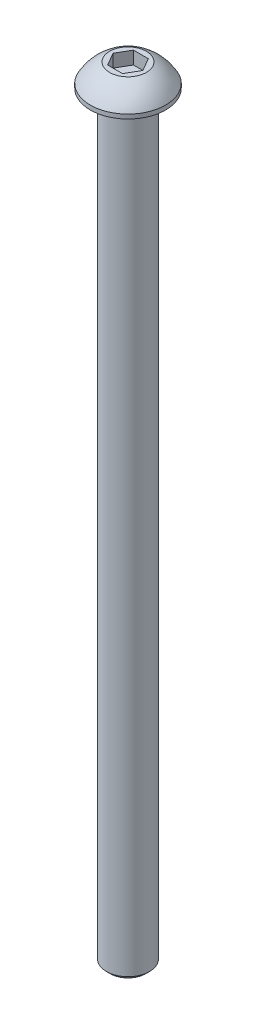
ISO-10303-21;
HEADER;
FILE_DESCRIPTION(('STEP AP214'),'2;1');
FILE_NAME('part.step','',(''),(''),'','','');
FILE_SCHEMA(('AUTOMOTIVE_DESIGN { 1 0 10303 214 1 1 1 1 }'));
ENDSEC;
DATA;
#1=APPLICATION_CONTEXT('core data for automotive mechanical design processes');
#2=APPLICATION_PROTOCOL_DEFINITION('international standard','automotive_design',2000,#1);
#3=PRODUCT_CONTEXT('',#1,'mechanical');
#4=PRODUCT('Part','Part','',(#3));
#5=PRODUCT_RELATED_PRODUCT_CATEGORY('part','',(#4));
#6=PRODUCT_DEFINITION_FORMATION('','',#4);
#7=PRODUCT_DEFINITION_CONTEXT('part definition',#1,'design');
#8=PRODUCT_DEFINITION('design','',#6,#7);
#9=PRODUCT_DEFINITION_SHAPE('','',#8);
#10=(LENGTH_UNIT() NAMED_UNIT(*) SI_UNIT(.MILLI.,.METRE.));
#11=(NAMED_UNIT(*) PLANE_ANGLE_UNIT() SI_UNIT($,.RADIAN.));
#12=(NAMED_UNIT(*) SI_UNIT($,.STERADIAN.) SOLID_ANGLE_UNIT());
#13=UNCERTAINTY_MEASURE_WITH_UNIT(LENGTH_MEASURE(1.E-05),#10,'distance_accuracy_value','');
#14=(GEOMETRIC_REPRESENTATION_CONTEXT(3) GLOBAL_UNCERTAINTY_ASSIGNED_CONTEXT((#13)) GLOBAL_UNIT_ASSIGNED_CONTEXT((#10,
#11,#12)) REPRESENTATION_CONTEXT('',''));
#15=CARTESIAN_POINT('',(0.,0.,0.));
#16=DIRECTION('',(0.,0.,1.));
#17=DIRECTION('',(1.,0.,0.));
#18=AXIS2_PLACEMENT_3D('',#15,#16,#17);
#19=CARTESIAN_POINT('',(0.,-139.7,0.));
#20=DIRECTION('',(0.,1.,0.));
#21=DIRECTION('',(-1.,0.,0.));
#22=AXIS2_PLACEMENT_3D('',#19,#20,#21);
#23=PLANE('',#22);
#24=CARTESIAN_POINT('',(0.,-139.7,0.));
#25=DIRECTION('',(0.,1.,0.));
#26=DIRECTION('',(-1.,0.,0.));
#27=AXIS2_PLACEMENT_3D('',#24,#25,#26);
#28=CIRCLE('',#27,3.26319444444444);
#29=CARTESIAN_POINT('',(-3.26319444444442,-139.7,0.));
#30=VERTEX_POINT('',#29);
#31=EDGE_CURVE('E11',#30,#30,#28,.T.);
#32=ORIENTED_EDGE('',*,*,#31,.F.);
#33=EDGE_LOOP('',(#32));
#34=FACE_BOUND('',#33,.T.);
#35=ADVANCED_FACE('F33',(#34),#23,.F.);
#36=CARTESIAN_POINT('',(0.,-139.7,0.));
#37=DIRECTION('',(0.,1.,0.));
#38=DIRECTION('',(-1.,0.,0.));
#39=AXIS2_PLACEMENT_3D('',#36,#37,#38);
#40=CONICAL_SURFACE('',#39,3.26319444444444,0.785398163397477);
#41=CARTESIAN_POINT('',(0.,-138.994444444444,0.));
#42=DIRECTION('',(0.,1.,0.));
#43=DIRECTION('',(-1.,0.,0.));
#44=AXIS2_PLACEMENT_3D('',#41,#42,#43);
#45=CIRCLE('',#44,3.96875);
#46=CARTESIAN_POINT('',(-3.96874999999998,-138.994444444444,0.));
#47=VERTEX_POINT('',#46);
#48=EDGE_CURVE('E40',#47,#47,#45,.T.);
#49=ORIENTED_EDGE('',*,*,#48,.F.);
#50=EDGE_LOOP('',(#49));
#51=FACE_BOUND('',#50,.T.);
#52=ORIENTED_EDGE('',*,*,#31,.T.);
#53=EDGE_LOOP('',(#52));
#54=FACE_BOUND('',#53,.T.);
#55=ADVANCED_FACE('F155',(#51,#54),#40,.T.);
#56=CARTESIAN_POINT('',(0.,69.088,0.));
#57=DIRECTION('',(0.,1.,0.));
#58=DIRECTION('',(-1.,0.,0.));
#59=AXIS2_PLACEMENT_3D('',#56,#57,#58);
#60=CYLINDRICAL_SURFACE('',#59,3.96875);
#61=CARTESIAN_POINT('',(0.,0.,0.));
#62=DIRECTION('',(0.,1.,0.));
#63=DIRECTION('',(-1.,0.,0.));
#64=AXIS2_PLACEMENT_3D('',#61,#62,#63);
#65=CIRCLE('',#64,3.96875);
#66=CARTESIAN_POINT('',(-3.96874999999999,0.,0.));
#67=VERTEX_POINT('',#66);
#68=EDGE_CURVE('E148',#67,#67,#65,.T.);
#69=ORIENTED_EDGE('',*,*,#68,.F.);
#70=EDGE_LOOP('',(#69));
#71=FACE_BOUND('',#70,.T.);
#72=ORIENTED_EDGE('',*,*,#48,.T.);
#73=EDGE_LOOP('',(#72));
#74=FACE_BOUND('',#73,.T.);
#75=ADVANCED_FACE('F153',(#71,#74),#60,.T.);
#76=CARTESIAN_POINT('',(3.96875000000001,0.,0.));
#77=DIRECTION('',(0.,1.,0.));
#78=DIRECTION('',(-1.,0.,0.));
#79=AXIS2_PLACEMENT_3D('',#76,#77,#78);
#80=PLANE('',#79);
#81=CARTESIAN_POINT('',(0.,0.,0.));
#82=DIRECTION('',(0.,1.,0.));
#83=DIRECTION('',(-1.,0.,0.));
#84=AXIS2_PLACEMENT_3D('',#81,#82,#83);
#85=CIRCLE('',#84,6.9469);
#86=CARTESIAN_POINT('',(-6.94689999999999,0.,0.));
#87=VERTEX_POINT('',#86);
#88=EDGE_CURVE('E145',#87,#87,#85,.T.);
#89=ORIENTED_EDGE('',*,*,#88,.F.);
#90=EDGE_LOOP('',(#89));
#91=FACE_BOUND('',#90,.T.);
#92=ORIENTED_EDGE('',*,*,#68,.T.);
#93=EDGE_LOOP('',(#92));
#94=FACE_BOUND('',#93,.T.);
#95=ADVANCED_FACE('F173',(#91,#94),#80,.F.);
#96=CARTESIAN_POINT('',(0.,69.088,0.));
#97=DIRECTION('',(0.,1.,0.));
#98=DIRECTION('',(-1.,0.,0.));
#99=AXIS2_PLACEMENT_3D('',#96,#97,#98);
#100=CYLINDRICAL_SURFACE('',#99,6.9469);
#101=CARTESIAN_POINT('',(0.,0.787399999999994,0.));
#102=DIRECTION('',(0.,1.,0.));
#103=DIRECTION('',(-1.,0.,0.));
#104=AXIS2_PLACEMENT_3D('',#101,#102,#103);
#105=CIRCLE('',#104,6.9469);
#106=CARTESIAN_POINT('',(-6.94689999999999,0.787399999999993,0.));
#107=VERTEX_POINT('',#106);
#108=EDGE_CURVE('E142',#107,#107,#105,.T.);
#109=ORIENTED_EDGE('',*,*,#108,.F.);
#110=EDGE_LOOP('',(#109));
#111=FACE_BOUND('',#110,.T.);
#112=ORIENTED_EDGE('',*,*,#88,.T.);
#113=EDGE_LOOP('',(#112));
#114=FACE_BOUND('',#113,.T.);
#115=ADVANCED_FACE('F181',(#111,#114),#100,.T.);
#116=CARTESIAN_POINT('',(0.,-2.86463469314528,0.));
#117=DIRECTION('',(0.,1.,0.));
#118=DIRECTION('',(1.,0.,0.));
#119=AXIS2_PLACEMENT_3D('',#116,#117,#118);
#120=SPHERICAL_SURFACE('',#119,7.84836142197444);
#121=CARTESIAN_POINT('',(0.,4.21639999999999,0.));
#122=DIRECTION('',(0.,1.,0.));
#123=DIRECTION('',(-1.,0.,0.));
#124=AXIS2_PLACEMENT_3D('',#121,#122,#123);
#125=CIRCLE('',#124,3.38463065701558);
#126=CARTESIAN_POINT('',(-3.38463065701557,4.21639999999999,0.));
#127=VERTEX_POINT('',#126);
#128=EDGE_CURVE('E134',#127,#127,#125,.T.);
#129=ORIENTED_EDGE('',*,*,#128,.F.);
#130=EDGE_LOOP('',(#129));
#131=FACE_BOUND('',#130,.T.);
#132=ORIENTED_EDGE('',*,*,#108,.T.);
#133=EDGE_LOOP('',(#132));
#134=FACE_BOUND('',#133,.T.);
#135=ADVANCED_FACE('F189',(#131,#134),#120,.T.);
#136=CARTESIAN_POINT('',(3.38463065701558,4.2164,0.));
#137=DIRECTION('',(0.,-1.,0.));
#138=DIRECTION('',(1.,0.,0.));
#139=AXIS2_PLACEMENT_3D('',#136,#137,#138);
#140=PLANE('',#139);
#141=DIRECTION('',(-0.5,0.,-0.866025403784439));
#142=VECTOR('',#141,1.);
#143=CARTESIAN_POINT('',(2.74963065701558,4.2164,0.));
#144=LINE('',#143,#142);
#145=CARTESIAN_POINT('',(2.74963065701558,4.2164,0.));
#146=VERTEX_POINT('',#145);
#147=CARTESIAN_POINT('',(1.37481532850779,4.2164,-2.38124999999999));
#148=VERTEX_POINT('',#147);
#149=EDGE_CURVE('E121',#146,#148,#144,.T.);
#150=ORIENTED_EDGE('',*,*,#149,.F.);
#151=DIRECTION('',(0.5,0.,-0.866025403784439));
#152=VECTOR('',#151,1.);
#153=CARTESIAN_POINT('',(1.37481532850779,4.2164,2.38124999999999));
#154=LINE('',#153,#152);
#155=CARTESIAN_POINT('',(1.37481532850779,4.2164,2.38124999999999));
#156=VERTEX_POINT('',#155);
#157=EDGE_CURVE('E47',#156,#146,#154,.T.);
#158=ORIENTED_EDGE('',*,*,#157,.F.);
#159=DIRECTION('',(1.,0.,0.));
#160=VECTOR('',#159,1.);
#161=CARTESIAN_POINT('',(-1.37481532850779,4.2164,2.38124999999999));
#162=LINE('',#161,#160);
#163=CARTESIAN_POINT('',(-1.37481532850779,4.2164,2.38124999999999));
#164=VERTEX_POINT('',#163);
#165=EDGE_CURVE('E130',#164,#156,#162,.T.);
#166=ORIENTED_EDGE('',*,*,#165,.F.);
#167=DIRECTION('',(0.5,0.,0.866025403784439));
#168=VECTOR('',#167,1.);
#169=CARTESIAN_POINT('',(-2.74963065701559,4.2164,0.));
#170=LINE('',#169,#168);
#171=CARTESIAN_POINT('',(-2.74963065701559,4.2164,0.));
#172=VERTEX_POINT('',#171);
#173=EDGE_CURVE('E128',#172,#164,#170,.T.);
#174=ORIENTED_EDGE('',*,*,#173,.F.);
#175=DIRECTION('',(-0.5,0.,0.866025403784439));
#176=VECTOR('',#175,1.);
#177=CARTESIAN_POINT('',(-1.37481532850779,4.2164,-2.38124999999999));
#178=LINE('',#177,#176);
#179=CARTESIAN_POINT('',(-1.37481532850779,4.2164,-2.38124999999999));
#180=VERTEX_POINT('',#179);
#181=EDGE_CURVE('E95',#180,#172,#178,.T.);
#182=ORIENTED_EDGE('',*,*,#181,.F.);
#183=DIRECTION('',(-1.,0.,0.));
#184=VECTOR('',#183,1.);
#185=CARTESIAN_POINT('',(1.37481532850779,4.2164,-2.38124999999999));
#186=LINE('',#185,#184);
#187=EDGE_CURVE('E124',#148,#180,#186,.T.);
#188=ORIENTED_EDGE('',*,*,#187,.F.);
#189=EDGE_LOOP('',(#150,#158,#166,#174,#182,#188));
#190=FACE_BOUND('',#189,.T.);
#191=ORIENTED_EDGE('',*,*,#128,.T.);
#192=EDGE_LOOP('',(#191));
#193=FACE_BOUND('',#192,.T.);
#194=ADVANCED_FACE('F197',(#190,#193),#140,.F.);
#195=CARTESIAN_POINT('',(1.37481532850779,1.83515,2.38124999999999));
#196=DIRECTION('',(0.866025403784439,0.,0.5));
#197=DIRECTION('',(0.5,0.,-0.866025403784439));
#198=AXIS2_PLACEMENT_3D('',#195,#196,#197);
#199=PLANE('',#198);
#200=ORIENTED_EDGE('',*,*,#157,.T.);
#201=DIRECTION('',(0.,1.,0.));
#202=VECTOR('',#201,1.);
#203=CARTESIAN_POINT('',(2.74963065701558,1.83515,0.));
#204=LINE('',#203,#202);
#205=CARTESIAN_POINT('',(2.74963065701558,1.83515,0.));
#206=VERTEX_POINT('',#205);
#207=EDGE_CURVE('E77',#206,#146,#204,.T.);
#208=ORIENTED_EDGE('',*,*,#207,.F.);
#209=DIRECTION('',(0.5,0.,-0.866025403784439));
#210=VECTOR('',#209,1.);
#211=CARTESIAN_POINT('',(1.37481532850779,1.83515,2.38124999999999));
#212=LINE('',#211,#210);
#213=CARTESIAN_POINT('',(1.37481532850779,1.83515,2.38124999999999));
#214=VERTEX_POINT('',#213);
#215=EDGE_CURVE('E132',#214,#206,#212,.T.);
#216=ORIENTED_EDGE('',*,*,#215,.F.);
#217=DIRECTION('',(0.,1.,0.));
#218=VECTOR('',#217,1.);
#219=CARTESIAN_POINT('',(1.37481532850779,1.83515,2.38124999999999));
#220=LINE('',#219,#218);
#221=EDGE_CURVE('E55',#214,#156,#220,.T.);
#222=ORIENTED_EDGE('',*,*,#221,.T.);
#223=EDGE_LOOP('',(#200,#208,#216,#222));
#224=FACE_BOUND('',#223,.T.);
#225=ADVANCED_FACE('F205',(#224),#199,.F.);
#226=CARTESIAN_POINT('',(-1.37481532850779,1.83515,2.38124999999999));
#227=DIRECTION('',(0.,0.,1.));
#228=DIRECTION('',(1.,0.,0.));
#229=AXIS2_PLACEMENT_3D('',#226,#227,#228);
#230=PLANE('',#229);
#231=ORIENTED_EDGE('',*,*,#165,.T.);
#232=ORIENTED_EDGE('',*,*,#221,.F.);
#233=DIRECTION('',(1.,0.,0.));
#234=VECTOR('',#233,1.);
#235=CARTESIAN_POINT('',(-1.37481532850779,1.83515,2.38124999999999));
#236=LINE('',#235,#234);
#237=CARTESIAN_POINT('',(-1.37481532850779,1.83515,2.38124999999999));
#238=VERTEX_POINT('',#237);
#239=EDGE_CURVE('E107',#238,#214,#236,.T.);
#240=ORIENTED_EDGE('',*,*,#239,.F.);
#241=DIRECTION('',(0.,1.,0.));
#242=VECTOR('',#241,1.);
#243=CARTESIAN_POINT('',(-1.37481532850779,1.83515,2.38124999999999));
#244=LINE('',#243,#242);
#245=EDGE_CURVE('E99',#238,#164,#244,.T.);
#246=ORIENTED_EDGE('',*,*,#245,.T.);
#247=EDGE_LOOP('',(#231,#232,#240,#246));
#248=FACE_BOUND('',#247,.T.);
#249=ADVANCED_FACE('F213',(#248),#230,.F.);
#250=CARTESIAN_POINT('',(-2.74963065701559,1.83515,0.));
#251=DIRECTION('',(-0.866025403784439,0.,0.5));
#252=DIRECTION('',(0.5,0.,0.866025403784439));
#253=AXIS2_PLACEMENT_3D('',#250,#251,#252);
#254=PLANE('',#253);
#255=ORIENTED_EDGE('',*,*,#173,.T.);
#256=ORIENTED_EDGE('',*,*,#245,.F.);
#257=DIRECTION('',(0.5,0.,0.866025403784439));
#258=VECTOR('',#257,1.);
#259=CARTESIAN_POINT('',(-2.74963065701559,1.83515,0.));
#260=LINE('',#259,#258);
#261=CARTESIAN_POINT('',(-2.74963065701559,1.83515,0.));
#262=VERTEX_POINT('',#261);
#263=EDGE_CURVE('E103',#262,#238,#260,.T.);
#264=ORIENTED_EDGE('',*,*,#263,.F.);
#265=DIRECTION('',(0.,1.,0.));
#266=VECTOR('',#265,1.);
#267=CARTESIAN_POINT('',(-2.74963065701559,1.83515,0.));
#268=LINE('',#267,#266);
#269=EDGE_CURVE('E88',#262,#172,#268,.T.);
#270=ORIENTED_EDGE('',*,*,#269,.T.);
#271=EDGE_LOOP('',(#255,#256,#264,#270));
#272=FACE_BOUND('',#271,.T.);
#273=ADVANCED_FACE('F104',(#272),#254,.F.);
#274=CARTESIAN_POINT('',(-1.37481532850779,1.83515,-2.38124999999999));
#275=DIRECTION('',(-0.866025403784439,0.,-0.5));
#276=DIRECTION('',(-0.5,0.,0.866025403784438));
#277=AXIS2_PLACEMENT_3D('',#274,#275,#276);
#278=PLANE('',#277);
#279=ORIENTED_EDGE('',*,*,#181,.T.);
#280=ORIENTED_EDGE('',*,*,#269,.F.);
#281=DIRECTION('',(-0.5,0.,0.866025403784439));
#282=VECTOR('',#281,1.);
#283=CARTESIAN_POINT('',(-1.37481532850779,1.83515,-2.38124999999999));
#284=LINE('',#283,#282);
#285=CARTESIAN_POINT('',(-1.37481532850779,1.83515,-2.38124999999999));
#286=VERTEX_POINT('',#285);
#287=EDGE_CURVE('E92',#286,#262,#284,.T.);
#288=ORIENTED_EDGE('',*,*,#287,.F.);
#289=DIRECTION('',(0.,1.,0.));
#290=VECTOR('',#289,1.);
#291=CARTESIAN_POINT('',(-1.37481532850779,1.83515,-2.38124999999999));
#292=LINE('',#291,#290);
#293=EDGE_CURVE('E100',#286,#180,#292,.T.);
#294=ORIENTED_EDGE('',*,*,#293,.T.);
#295=EDGE_LOOP('',(#279,#280,#288,#294));
#296=FACE_BOUND('',#295,.T.);
#297=ADVANCED_FACE('F90',(#296),#278,.F.);
#298=CARTESIAN_POINT('',(1.37481532850779,1.83515,-2.38124999999999));
#299=DIRECTION('',(0.,0.,-1.));
#300=DIRECTION('',(-1.,0.,0.));
#301=AXIS2_PLACEMENT_3D('',#298,#299,#300);
#302=PLANE('',#301);
#303=ORIENTED_EDGE('',*,*,#187,.T.);
#304=ORIENTED_EDGE('',*,*,#293,.F.);
#305=DIRECTION('',(-1.,0.,0.));
#306=VECTOR('',#305,1.);
#307=CARTESIAN_POINT('',(1.37481532850779,1.83515,-2.38124999999999));
#308=LINE('',#307,#306);
#309=CARTESIAN_POINT('',(1.37481532850779,1.83515,-2.38124999999999));
#310=VERTEX_POINT('',#309);
#311=EDGE_CURVE('E113',#310,#286,#308,.T.);
#312=ORIENTED_EDGE('',*,*,#311,.F.);
#313=DIRECTION('',(0.,1.,0.));
#314=VECTOR('',#313,1.);
#315=CARTESIAN_POINT('',(1.37481532850779,1.83515,-2.38124999999999));
#316=LINE('',#315,#314);
#317=EDGE_CURVE('E137',#310,#148,#316,.T.);
#318=ORIENTED_EDGE('',*,*,#317,.T.);
#319=EDGE_LOOP('',(#303,#304,#312,#318));
#320=FACE_BOUND('',#319,.T.);
#321=ADVANCED_FACE('F232',(#320),#302,.F.);
#322=CARTESIAN_POINT('',(2.74963065701558,1.83515,0.));
#323=DIRECTION('',(0.866025403784439,0.,-0.5));
#324=DIRECTION('',(-0.5,0.,-0.866025403784439));
#325=AXIS2_PLACEMENT_3D('',#322,#323,#324);
#326=PLANE('',#325);
#327=ORIENTED_EDGE('',*,*,#149,.T.);
#328=ORIENTED_EDGE('',*,*,#317,.F.);
#329=DIRECTION('',(-0.5,0.,-0.866025403784439));
#330=VECTOR('',#329,1.);
#331=CARTESIAN_POINT('',(2.74963065701558,1.83515,0.));
#332=LINE('',#331,#330);
#333=EDGE_CURVE('E115',#206,#310,#332,.T.);
#334=ORIENTED_EDGE('',*,*,#333,.F.);
#335=ORIENTED_EDGE('',*,*,#207,.T.);
#336=EDGE_LOOP('',(#327,#328,#334,#335));
#337=FACE_BOUND('',#336,.T.);
#338=ADVANCED_FACE('F239',(#337),#326,.F.);
#339=CARTESIAN_POINT('',(4.12444598552338,1.83515,-2.38124999999999));
#340=DIRECTION('',(0.,1.,0.));
#341=DIRECTION('',(0.,0.,1.));
#342=AXIS2_PLACEMENT_3D('',#339,#340,#341);
#343=PLANE('',#342);
#344=ORIENTED_EDGE('',*,*,#215,.T.);
#345=ORIENTED_EDGE('',*,*,#333,.T.);
#346=ORIENTED_EDGE('',*,*,#311,.T.);
#347=ORIENTED_EDGE('',*,*,#287,.T.);
#348=ORIENTED_EDGE('',*,*,#263,.T.);
#349=ORIENTED_EDGE('',*,*,#239,.T.);
#350=EDGE_LOOP('',(#344,#345,#346,#347,#348,#349));
#351=FACE_BOUND('',#350,.T.);
#352=ADVANCED_FACE('F110',(#351),#343,.T.);
#353=CLOSED_SHELL('',(#35,#55,#75,#95,#115,#135,#194,#225,#249,#273,#297,#321,#338,#352));
#354=MANIFOLD_SOLID_BREP('B2',#353);
#355=ADVANCED_BREP_SHAPE_REPRESENTATION('',(#18,#354),#14);
#356=SHAPE_DEFINITION_REPRESENTATION(#9,#355);
ENDSEC;
END-ISO-10303-21;
